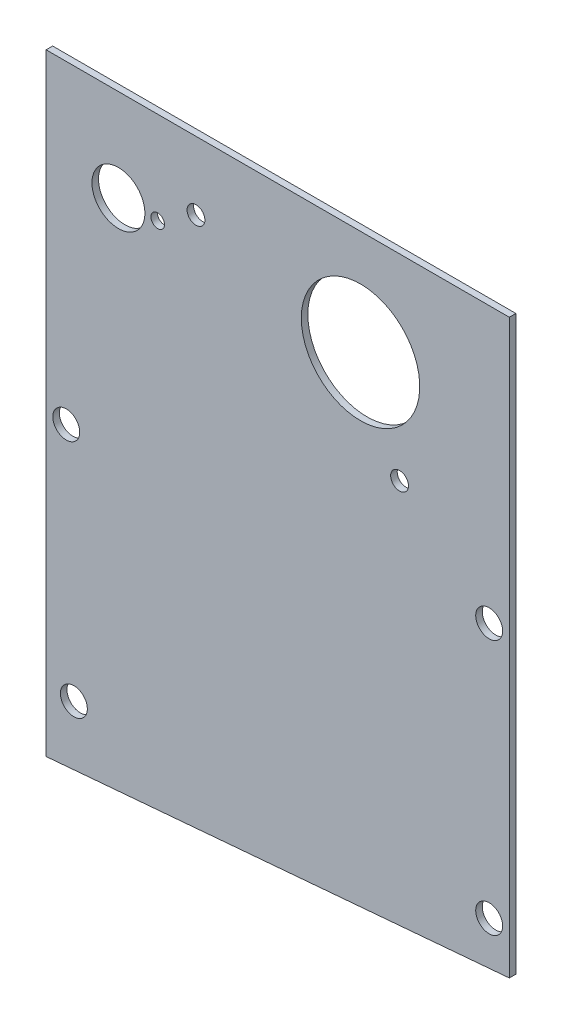
ISO-10303-21;
HEADER;
FILE_DESCRIPTION(('STEP AP214'),'2;1');
FILE_NAME('part.step','',(''),(''),'','','');
FILE_SCHEMA(('AUTOMOTIVE_DESIGN { 1 0 10303 214 1 1 1 1 }'));
ENDSEC;
DATA;
#1=APPLICATION_CONTEXT('core data for automotive mechanical design processes');
#2=APPLICATION_PROTOCOL_DEFINITION('international standard','automotive_design',2000,#1);
#3=PRODUCT_CONTEXT('',#1,'mechanical');
#4=PRODUCT('Part','Part','',(#3));
#5=PRODUCT_RELATED_PRODUCT_CATEGORY('part','',(#4));
#6=PRODUCT_DEFINITION_FORMATION('','',#4);
#7=PRODUCT_DEFINITION_CONTEXT('part definition',#1,'design');
#8=PRODUCT_DEFINITION('design','',#6,#7);
#9=PRODUCT_DEFINITION_SHAPE('','',#8);
#10=(LENGTH_UNIT() NAMED_UNIT(*) SI_UNIT(.MILLI.,.METRE.));
#11=(NAMED_UNIT(*) PLANE_ANGLE_UNIT() SI_UNIT($,.RADIAN.));
#12=(NAMED_UNIT(*) SI_UNIT($,.STERADIAN.) SOLID_ANGLE_UNIT());
#13=UNCERTAINTY_MEASURE_WITH_UNIT(LENGTH_MEASURE(1.E-05),#10,'distance_accuracy_value','');
#14=(GEOMETRIC_REPRESENTATION_CONTEXT(3) GLOBAL_UNCERTAINTY_ASSIGNED_CONTEXT((#13)) GLOBAL_UNIT_ASSIGNED_CONTEXT((#10,
#11,#12)) REPRESENTATION_CONTEXT('',''));
#15=CARTESIAN_POINT('',(0.,0.,0.));
#16=DIRECTION('',(0.,0.,1.));
#17=DIRECTION('',(1.,0.,0.));
#18=AXIS2_PLACEMENT_3D('',#15,#16,#17);
#19=CARTESIAN_POINT('',(56.134,-74.168,1.5875));
#20=DIRECTION('',(0.,0.,1.));
#21=DIRECTION('',(1.,0.,0.));
#22=AXIS2_PLACEMENT_3D('',#19,#20,#21);
#23=PLANE('',#22);
#24=CARTESIAN_POINT('',(76.2,-25.4,1.5875));
#25=DIRECTION('',(0.,0.,-1.));
#26=DIRECTION('',(-1.,0.,0.));
#27=AXIS2_PLACEMENT_3D('',#24,#25,#26);
#28=CIRCLE('',#27,14.351);
#29=CARTESIAN_POINT('',(61.849,-25.4,1.5875));
#30=VERTEX_POINT('',#29);
#31=EDGE_CURVE('E106',#30,#30,#28,.T.);
#32=ORIENTED_EDGE('',*,*,#31,.T.);
#33=EDGE_LOOP('',(#32));
#34=FACE_BOUND('',#33,.T.);
#35=CARTESIAN_POINT('',(36.322,-16.51,1.5875));
#36=DIRECTION('',(0.,0.,-1.));
#37=DIRECTION('',(-1.,0.,0.));
#38=AXIS2_PLACEMENT_3D('',#35,#36,#37);
#39=CIRCLE('',#38,2.159);
#40=CARTESIAN_POINT('',(34.163,-16.51,1.5875));
#41=VERTEX_POINT('',#40);
#42=EDGE_CURVE('E109',#41,#41,#39,.T.);
#43=ORIENTED_EDGE('',*,*,#42,.T.);
#44=EDGE_LOOP('',(#43));
#45=FACE_BOUND('',#44,.T.);
#46=CARTESIAN_POINT('',(85.6615,-47.625,1.5875));
#47=DIRECTION('',(0.,0.,-1.));
#48=DIRECTION('',(-1.,0.,0.));
#49=AXIS2_PLACEMENT_3D('',#46,#47,#48);
#50=CIRCLE('',#49,2.15899999999999);
#51=CARTESIAN_POINT('',(83.5025,-47.625,1.5875));
#52=VERTEX_POINT('',#51);
#53=EDGE_CURVE('E112',#52,#52,#50,.T.);
#54=ORIENTED_EDGE('',*,*,#53,.T.);
#55=EDGE_LOOP('',(#54));
#56=FACE_BOUND('',#55,.T.);
#57=CARTESIAN_POINT('',(27.051,-22.352,1.5875));
#58=DIRECTION('',(0.,0.,-1.));
#59=DIRECTION('',(-1.,0.,0.));
#60=AXIS2_PLACEMENT_3D('',#57,#58,#59);
#61=CIRCLE('',#60,1.651);
#62=CARTESIAN_POINT('',(25.4,-22.352,1.5875));
#63=VERTEX_POINT('',#62);
#64=EDGE_CURVE('E115',#63,#63,#61,.T.);
#65=ORIENTED_EDGE('',*,*,#64,.T.);
#66=EDGE_LOOP('',(#65));
#67=FACE_BOUND('',#66,.T.);
#68=CARTESIAN_POINT('',(17.526,-22.352,1.5875));
#69=DIRECTION('',(0.,0.,-1.));
#70=DIRECTION('',(-1.,0.,0.));
#71=AXIS2_PLACEMENT_3D('',#68,#69,#70);
#72=CIRCLE('',#71,6.4135);
#73=CARTESIAN_POINT('',(11.1125,-22.352,1.5875));
#74=VERTEX_POINT('',#73);
#75=EDGE_CURVE('E118',#74,#74,#72,.T.);
#76=ORIENTED_EDGE('',*,*,#75,.T.);
#77=EDGE_LOOP('',(#76));
#78=FACE_BOUND('',#77,.T.);
#79=CARTESIAN_POINT('',(107.3785,-128.5875,1.5875));
#80=DIRECTION('',(0.,0.,-1.));
#81=DIRECTION('',(-1.,0.,0.));
#82=AXIS2_PLACEMENT_3D('',#79,#80,#81);
#83=CIRCLE('',#82,3.2639);
#84=CARTESIAN_POINT('',(104.1146,-128.5875,1.5875));
#85=VERTEX_POINT('',#84);
#86=EDGE_CURVE('E121',#85,#85,#83,.T.);
#87=ORIENTED_EDGE('',*,*,#86,.T.);
#88=EDGE_LOOP('',(#87));
#89=FACE_BOUND('',#88,.T.);
#90=CARTESIAN_POINT('',(4.8895,-76.2,1.5875));
#91=DIRECTION('',(0.,0.,-1.));
#92=DIRECTION('',(-1.,0.,0.));
#93=AXIS2_PLACEMENT_3D('',#90,#91,#92);
#94=CIRCLE('',#93,3.2639);
#95=CARTESIAN_POINT('',(1.6256,-76.2,1.5875));
#96=VERTEX_POINT('',#95);
#97=EDGE_CURVE('E124',#96,#96,#94,.T.);
#98=ORIENTED_EDGE('',*,*,#97,.T.);
#99=EDGE_LOOP('',(#98));
#100=FACE_BOUND('',#99,.T.);
#101=CARTESIAN_POINT('',(6.731,-133.35,1.5875));
#102=DIRECTION('',(0.,0.,-1.));
#103=DIRECTION('',(-1.,0.,0.));
#104=AXIS2_PLACEMENT_3D('',#101,#102,#103);
#105=CIRCLE('',#104,3.2639);
#106=CARTESIAN_POINT('',(3.4671,-133.35,1.5875));
#107=VERTEX_POINT('',#106);
#108=EDGE_CURVE('E126',#107,#107,#105,.T.);
#109=ORIENTED_EDGE('',*,*,#108,.T.);
#110=EDGE_LOOP('',(#109));
#111=FACE_BOUND('',#110,.T.);
#112=CARTESIAN_POINT('',(107.3785,-66.675,1.5875));
#113=DIRECTION('',(0.,0.,-1.));
#114=DIRECTION('',(-1.,0.,0.));
#115=AXIS2_PLACEMENT_3D('',#112,#113,#114);
#116=CIRCLE('',#115,3.2639);
#117=CARTESIAN_POINT('',(104.1146,-66.675,1.5875));
#118=VERTEX_POINT('',#117);
#119=EDGE_CURVE('E19',#118,#118,#116,.T.);
#120=ORIENTED_EDGE('',*,*,#119,.T.);
#121=EDGE_LOOP('',(#120));
#122=FACE_BOUND('',#121,.T.);
#123=DIRECTION('',(1.,0.,0.));
#124=VECTOR('',#123,1.);
#125=CARTESIAN_POINT('',(112.268,0.,1.5875));
#126=LINE('',#125,#124);
#127=CARTESIAN_POINT('',(0.,0.,1.5875));
#128=VERTEX_POINT('',#127);
#129=CARTESIAN_POINT('',(112.268,0.,1.5875));
#130=VERTEX_POINT('',#129);
#131=EDGE_CURVE('E58',#128,#130,#126,.T.);
#132=ORIENTED_EDGE('',*,*,#131,.F.);
#133=DIRECTION('',(0.,1.,0.));
#134=VECTOR('',#133,1.);
#135=CARTESIAN_POINT('',(0.,0.,1.5875));
#136=LINE('',#135,#134);
#137=CARTESIAN_POINT('',(0.,-148.336,1.5875));
#138=VERTEX_POINT('',#137);
#139=EDGE_CURVE('E53',#138,#128,#136,.T.);
#140=ORIENTED_EDGE('',*,*,#139,.F.);
#141=DIRECTION('',(0.996324696011355,0.0856568743177184,0.));
#142=VECTOR('',#141,1.);
#143=CARTESIAN_POINT('',(0.,-148.336,1.5875));
#144=LINE('',#143,#142);
#145=CARTESIAN_POINT('',(112.268,-138.684,1.5875));
#146=VERTEX_POINT('',#145);
#147=EDGE_CURVE('E70',#146,#138,#144,.F.);
#148=ORIENTED_EDGE('',*,*,#147,.F.);
#149=DIRECTION('',(0.,1.,0.));
#150=VECTOR('',#149,1.);
#151=CARTESIAN_POINT('',(112.268,-138.684,1.5875));
#152=LINE('',#151,#150);
#153=EDGE_CURVE('E67',#130,#146,#152,.F.);
#154=ORIENTED_EDGE('',*,*,#153,.F.);
#155=EDGE_LOOP('',(#132,#140,#148,#154));
#156=FACE_BOUND('',#155,.T.);
#157=ADVANCED_FACE('F16',(#34,#45,#56,#67,#78,#89,#100,#111,#122,#156),#23,.T.);
#158=CARTESIAN_POINT('',(112.268,-138.684,0.));
#159=DIRECTION('',(1.,0.,0.));
#160=DIRECTION('',(0.,0.,-1.));
#161=AXIS2_PLACEMENT_3D('',#158,#159,#160);
#162=PLANE('',#161);
#163=ORIENTED_EDGE('',*,*,#153,.T.);
#164=DIRECTION('',(0.,0.,1.));
#165=VECTOR('',#164,1.);
#166=CARTESIAN_POINT('',(112.268,-138.684,0.));
#167=LINE('',#166,#165);
#168=CARTESIAN_POINT('',(112.268,-138.684,0.));
#169=VERTEX_POINT('',#168);
#170=EDGE_CURVE('E134',#169,#146,#167,.T.);
#171=ORIENTED_EDGE('',*,*,#170,.F.);
#172=DIRECTION('',(0.,1.,0.));
#173=VECTOR('',#172,1.);
#174=CARTESIAN_POINT('',(112.268,-74.168,0.));
#175=LINE('',#174,#173);
#176=CARTESIAN_POINT('',(112.268,0.,0.));
#177=VERTEX_POINT('',#176);
#178=EDGE_CURVE('E77',#169,#177,#175,.T.);
#179=ORIENTED_EDGE('',*,*,#178,.T.);
#180=DIRECTION('',(0.,0.,1.));
#181=VECTOR('',#180,1.);
#182=CARTESIAN_POINT('',(112.268,0.,0.));
#183=LINE('',#182,#181);
#184=EDGE_CURVE('E63',#130,#177,#183,.F.);
#185=ORIENTED_EDGE('',*,*,#184,.F.);
#186=EDGE_LOOP('',(#163,#171,#179,#185));
#187=FACE_BOUND('',#186,.T.);
#188=ADVANCED_FACE('F76',(#187),#162,.T.);
#189=CARTESIAN_POINT('',(112.268,0.,0.));
#190=DIRECTION('',(0.,1.,0.));
#191=DIRECTION('',(0.,0.,1.));
#192=AXIS2_PLACEMENT_3D('',#189,#190,#191);
#193=PLANE('',#192);
#194=ORIENTED_EDGE('',*,*,#131,.T.);
#195=ORIENTED_EDGE('',*,*,#184,.T.);
#196=DIRECTION('',(1.,0.,0.));
#197=VECTOR('',#196,1.);
#198=CARTESIAN_POINT('',(56.134,0.,0.));
#199=LINE('',#198,#197);
#200=CARTESIAN_POINT('',(0.,0.,0.));
#201=VERTEX_POINT('',#200);
#202=EDGE_CURVE('E145',#177,#201,#199,.F.);
#203=ORIENTED_EDGE('',*,*,#202,.T.);
#204=DIRECTION('',(0.,0.,1.));
#205=VECTOR('',#204,1.);
#206=CARTESIAN_POINT('',(0.,0.,0.));
#207=LINE('',#206,#205);
#208=EDGE_CURVE('E65',#128,#201,#207,.F.);
#209=ORIENTED_EDGE('',*,*,#208,.F.);
#210=EDGE_LOOP('',(#194,#195,#203,#209));
#211=FACE_BOUND('',#210,.T.);
#212=ADVANCED_FACE('F60',(#211),#193,.T.);
#213=CARTESIAN_POINT('',(0.,0.,0.));
#214=DIRECTION('',(-1.,0.,0.));
#215=DIRECTION('',(0.,0.,1.));
#216=AXIS2_PLACEMENT_3D('',#213,#214,#215);
#217=PLANE('',#216);
#218=ORIENTED_EDGE('',*,*,#139,.T.);
#219=ORIENTED_EDGE('',*,*,#208,.T.);
#220=DIRECTION('',(0.,1.,0.));
#221=VECTOR('',#220,1.);
#222=CARTESIAN_POINT('',(0.,-74.168,0.));
#223=LINE('',#222,#221);
#224=CARTESIAN_POINT('',(0.,-148.336,0.));
#225=VERTEX_POINT('',#224);
#226=EDGE_CURVE('E142',#201,#225,#223,.F.);
#227=ORIENTED_EDGE('',*,*,#226,.T.);
#228=DIRECTION('',(0.,0.,1.));
#229=VECTOR('',#228,1.);
#230=CARTESIAN_POINT('',(0.,-148.336,0.));
#231=LINE('',#230,#229);
#232=EDGE_CURVE('E34',#138,#225,#231,.F.);
#233=ORIENTED_EDGE('',*,*,#232,.F.);
#234=EDGE_LOOP('',(#218,#219,#227,#233));
#235=FACE_BOUND('',#234,.T.);
#236=ADVANCED_FACE('F141',(#235),#217,.T.);
#237=CARTESIAN_POINT('',(0.,-148.336,0.));
#238=DIRECTION('',(0.0856568743177184,-0.996324696011355,0.));
#239=DIRECTION('',(0.996324696011355,0.0856568743177184,0.));
#240=AXIS2_PLACEMENT_3D('',#237,#238,#239);
#241=PLANE('',#240);
#242=ORIENTED_EDGE('',*,*,#147,.T.);
#243=ORIENTED_EDGE('',*,*,#232,.T.);
#244=DIRECTION('',(0.996324696011355,0.0856568743177182,0.));
#245=VECTOR('',#244,1.);
#246=CARTESIAN_POINT('',(0.,-148.336,0.));
#247=LINE('',#246,#245);
#248=EDGE_CURVE('E105',#225,#169,#247,.T.);
#249=ORIENTED_EDGE('',*,*,#248,.T.);
#250=ORIENTED_EDGE('',*,*,#170,.T.);
#251=EDGE_LOOP('',(#242,#243,#249,#250));
#252=FACE_BOUND('',#251,.T.);
#253=ADVANCED_FACE('F148',(#252),#241,.T.);
#254=CARTESIAN_POINT('',(107.3785,-66.675,1.5875));
#255=DIRECTION('',(0.,0.,-1.));
#256=DIRECTION('',(-1.,0.,0.));
#257=AXIS2_PLACEMENT_3D('',#254,#255,#256);
#258=CYLINDRICAL_SURFACE('',#257,3.2639);
#259=CARTESIAN_POINT('',(107.3785,-66.675,0.));
#260=DIRECTION('',(0.,0.,-1.));
#261=DIRECTION('',(-1.,0.,0.));
#262=AXIS2_PLACEMENT_3D('',#259,#260,#261);
#263=CIRCLE('',#262,3.2639);
#264=CARTESIAN_POINT('',(104.1146,-66.675,0.));
#265=VERTEX_POINT('',#264);
#266=EDGE_CURVE('E102',#265,#265,#263,.T.);
#267=ORIENTED_EDGE('',*,*,#266,.T.);
#268=EDGE_LOOP('',(#267));
#269=FACE_BOUND('',#268,.T.);
#270=ORIENTED_EDGE('',*,*,#119,.F.);
#271=EDGE_LOOP('',(#270));
#272=FACE_BOUND('',#271,.T.);
#273=ADVANCED_FACE('F150',(#269,#272),#258,.F.);
#274=CARTESIAN_POINT('',(6.731,-133.35,1.5875));
#275=DIRECTION('',(0.,0.,-1.));
#276=DIRECTION('',(-1.,0.,0.));
#277=AXIS2_PLACEMENT_3D('',#274,#275,#276);
#278=CYLINDRICAL_SURFACE('',#277,3.2639);
#279=CARTESIAN_POINT('',(6.731,-133.35,0.));
#280=DIRECTION('',(0.,0.,-1.));
#281=DIRECTION('',(-1.,0.,0.));
#282=AXIS2_PLACEMENT_3D('',#279,#280,#281);
#283=CIRCLE('',#282,3.2639);
#284=CARTESIAN_POINT('',(3.4671,-133.35,0.));
#285=VERTEX_POINT('',#284);
#286=EDGE_CURVE('E99',#285,#285,#283,.T.);
#287=ORIENTED_EDGE('',*,*,#286,.T.);
#288=EDGE_LOOP('',(#287));
#289=FACE_BOUND('',#288,.T.);
#290=ORIENTED_EDGE('',*,*,#108,.F.);
#291=EDGE_LOOP('',(#290));
#292=FACE_BOUND('',#291,.T.);
#293=ADVANCED_FACE('F157',(#289,#292),#278,.F.);
#294=CARTESIAN_POINT('',(4.8895,-76.2,1.5875));
#295=DIRECTION('',(0.,0.,-1.));
#296=DIRECTION('',(-1.,0.,0.));
#297=AXIS2_PLACEMENT_3D('',#294,#295,#296);
#298=CYLINDRICAL_SURFACE('',#297,3.2639);
#299=CARTESIAN_POINT('',(4.8895,-76.2,0.));
#300=DIRECTION('',(0.,0.,-1.));
#301=DIRECTION('',(-1.,0.,0.));
#302=AXIS2_PLACEMENT_3D('',#299,#300,#301);
#303=CIRCLE('',#302,3.2639);
#304=CARTESIAN_POINT('',(1.6256,-76.2,0.));
#305=VERTEX_POINT('',#304);
#306=EDGE_CURVE('E96',#305,#305,#303,.T.);
#307=ORIENTED_EDGE('',*,*,#306,.T.);
#308=EDGE_LOOP('',(#307));
#309=FACE_BOUND('',#308,.T.);
#310=ORIENTED_EDGE('',*,*,#97,.F.);
#311=EDGE_LOOP('',(#310));
#312=FACE_BOUND('',#311,.T.);
#313=ADVANCED_FACE('F192',(#309,#312),#298,.F.);
#314=CARTESIAN_POINT('',(107.3785,-128.5875,1.5875));
#315=DIRECTION('',(0.,0.,-1.));
#316=DIRECTION('',(-1.,0.,0.));
#317=AXIS2_PLACEMENT_3D('',#314,#315,#316);
#318=CYLINDRICAL_SURFACE('',#317,3.2639);
#319=CARTESIAN_POINT('',(107.3785,-128.5875,0.));
#320=DIRECTION('',(0.,0.,-1.));
#321=DIRECTION('',(-1.,0.,0.));
#322=AXIS2_PLACEMENT_3D('',#319,#320,#321);
#323=CIRCLE('',#322,3.2639);
#324=CARTESIAN_POINT('',(104.1146,-128.5875,0.));
#325=VERTEX_POINT('',#324);
#326=EDGE_CURVE('E93',#325,#325,#323,.T.);
#327=ORIENTED_EDGE('',*,*,#326,.T.);
#328=EDGE_LOOP('',(#327));
#329=FACE_BOUND('',#328,.T.);
#330=ORIENTED_EDGE('',*,*,#86,.F.);
#331=EDGE_LOOP('',(#330));
#332=FACE_BOUND('',#331,.T.);
#333=ADVANCED_FACE('F188',(#329,#332),#318,.F.);
#334=CARTESIAN_POINT('',(17.526,-22.352,1.5875));
#335=DIRECTION('',(0.,0.,-1.));
#336=DIRECTION('',(-1.,0.,0.));
#337=AXIS2_PLACEMENT_3D('',#334,#335,#336);
#338=CYLINDRICAL_SURFACE('',#337,6.4135);
#339=CARTESIAN_POINT('',(17.526,-22.352,0.));
#340=DIRECTION('',(0.,0.,-1.));
#341=DIRECTION('',(-1.,0.,0.));
#342=AXIS2_PLACEMENT_3D('',#339,#340,#341);
#343=CIRCLE('',#342,6.4135);
#344=CARTESIAN_POINT('',(11.1125,-22.352,0.));
#345=VERTEX_POINT('',#344);
#346=EDGE_CURVE('E90',#345,#345,#343,.T.);
#347=ORIENTED_EDGE('',*,*,#346,.T.);
#348=EDGE_LOOP('',(#347));
#349=FACE_BOUND('',#348,.T.);
#350=ORIENTED_EDGE('',*,*,#75,.F.);
#351=EDGE_LOOP('',(#350));
#352=FACE_BOUND('',#351,.T.);
#353=ADVANCED_FACE('F184',(#349,#352),#338,.F.);
#354=CARTESIAN_POINT('',(27.051,-22.352,1.5875));
#355=DIRECTION('',(0.,0.,-1.));
#356=DIRECTION('',(-1.,0.,0.));
#357=AXIS2_PLACEMENT_3D('',#354,#355,#356);
#358=CYLINDRICAL_SURFACE('',#357,1.651);
#359=CARTESIAN_POINT('',(27.051,-22.352,0.));
#360=DIRECTION('',(0.,0.,-1.));
#361=DIRECTION('',(-1.,0.,0.));
#362=AXIS2_PLACEMENT_3D('',#359,#360,#361);
#363=CIRCLE('',#362,1.651);
#364=CARTESIAN_POINT('',(25.4,-22.352,0.));
#365=VERTEX_POINT('',#364);
#366=EDGE_CURVE('E87',#365,#365,#363,.T.);
#367=ORIENTED_EDGE('',*,*,#366,.T.);
#368=EDGE_LOOP('',(#367));
#369=FACE_BOUND('',#368,.T.);
#370=ORIENTED_EDGE('',*,*,#64,.F.);
#371=EDGE_LOOP('',(#370));
#372=FACE_BOUND('',#371,.T.);
#373=ADVANCED_FACE('F180',(#369,#372),#358,.F.);
#374=CARTESIAN_POINT('',(85.6615,-47.625,7.4295));
#375=DIRECTION('',(0.,0.,-1.));
#376=DIRECTION('',(-1.,0.,0.));
#377=AXIS2_PLACEMENT_3D('',#374,#375,#376);
#378=CYLINDRICAL_SURFACE('',#377,2.15899999999999);
#379=CARTESIAN_POINT('',(85.6615,-47.625,0.));
#380=DIRECTION('',(0.,0.,-1.));
#381=DIRECTION('',(-1.,0.,0.));
#382=AXIS2_PLACEMENT_3D('',#379,#380,#381);
#383=CIRCLE('',#382,2.15899999999999);
#384=CARTESIAN_POINT('',(83.5025,-47.625,0.));
#385=VERTEX_POINT('',#384);
#386=EDGE_CURVE('E84',#385,#385,#383,.T.);
#387=ORIENTED_EDGE('',*,*,#386,.T.);
#388=EDGE_LOOP('',(#387));
#389=FACE_BOUND('',#388,.T.);
#390=ORIENTED_EDGE('',*,*,#53,.F.);
#391=EDGE_LOOP('',(#390));
#392=FACE_BOUND('',#391,.T.);
#393=ADVANCED_FACE('F176',(#389,#392),#378,.F.);
#394=CARTESIAN_POINT('',(36.322,-16.51,7.4295));
#395=DIRECTION('',(0.,0.,-1.));
#396=DIRECTION('',(-1.,0.,0.));
#397=AXIS2_PLACEMENT_3D('',#394,#395,#396);
#398=CYLINDRICAL_SURFACE('',#397,2.159);
#399=CARTESIAN_POINT('',(36.322,-16.51,0.));
#400=DIRECTION('',(0.,0.,-1.));
#401=DIRECTION('',(-1.,0.,0.));
#402=AXIS2_PLACEMENT_3D('',#399,#400,#401);
#403=CIRCLE('',#402,2.159);
#404=CARTESIAN_POINT('',(34.163,-16.51,0.));
#405=VERTEX_POINT('',#404);
#406=EDGE_CURVE('E25',#405,#405,#403,.T.);
#407=ORIENTED_EDGE('',*,*,#406,.T.);
#408=EDGE_LOOP('',(#407));
#409=FACE_BOUND('',#408,.T.);
#410=ORIENTED_EDGE('',*,*,#42,.F.);
#411=EDGE_LOOP('',(#410));
#412=FACE_BOUND('',#411,.T.);
#413=ADVANCED_FACE('F168',(#409,#412),#398,.F.);
#414=CARTESIAN_POINT('',(76.2,-25.4,1.5875));
#415=DIRECTION('',(0.,0.,-1.));
#416=DIRECTION('',(-1.,0.,0.));
#417=AXIS2_PLACEMENT_3D('',#414,#415,#416);
#418=CYLINDRICAL_SURFACE('',#417,14.351);
#419=CARTESIAN_POINT('',(76.2,-25.4,0.));
#420=DIRECTION('',(0.,0.,-1.));
#421=DIRECTION('',(-1.,0.,0.));
#422=AXIS2_PLACEMENT_3D('',#419,#420,#421);
#423=CIRCLE('',#422,14.351);
#424=CARTESIAN_POINT('',(61.849,-25.4,0.));
#425=VERTEX_POINT('',#424);
#426=EDGE_CURVE('E11',#425,#425,#423,.T.);
#427=ORIENTED_EDGE('',*,*,#426,.T.);
#428=EDGE_LOOP('',(#427));
#429=FACE_BOUND('',#428,.T.);
#430=ORIENTED_EDGE('',*,*,#31,.F.);
#431=EDGE_LOOP('',(#430));
#432=FACE_BOUND('',#431,.T.);
#433=ADVANCED_FACE('F162',(#429,#432),#418,.F.);
#434=CARTESIAN_POINT('',(56.134,-74.168,0.));
#435=DIRECTION('',(0.,0.,1.));
#436=DIRECTION('',(1.,0.,0.));
#437=AXIS2_PLACEMENT_3D('',#434,#435,#436);
#438=PLANE('',#437);
#439=ORIENTED_EDGE('',*,*,#426,.F.);
#440=EDGE_LOOP('',(#439));
#441=FACE_BOUND('',#440,.T.);
#442=ORIENTED_EDGE('',*,*,#406,.F.);
#443=EDGE_LOOP('',(#442));
#444=FACE_BOUND('',#443,.T.);
#445=ORIENTED_EDGE('',*,*,#386,.F.);
#446=EDGE_LOOP('',(#445));
#447=FACE_BOUND('',#446,.T.);
#448=ORIENTED_EDGE('',*,*,#366,.F.);
#449=EDGE_LOOP('',(#448));
#450=FACE_BOUND('',#449,.T.);
#451=ORIENTED_EDGE('',*,*,#346,.F.);
#452=EDGE_LOOP('',(#451));
#453=FACE_BOUND('',#452,.T.);
#454=ORIENTED_EDGE('',*,*,#326,.F.);
#455=EDGE_LOOP('',(#454));
#456=FACE_BOUND('',#455,.T.);
#457=ORIENTED_EDGE('',*,*,#306,.F.);
#458=EDGE_LOOP('',(#457));
#459=FACE_BOUND('',#458,.T.);
#460=ORIENTED_EDGE('',*,*,#286,.F.);
#461=EDGE_LOOP('',(#460));
#462=FACE_BOUND('',#461,.T.);
#463=ORIENTED_EDGE('',*,*,#266,.F.);
#464=EDGE_LOOP('',(#463));
#465=FACE_BOUND('',#464,.T.);
#466=ORIENTED_EDGE('',*,*,#226,.F.);
#467=ORIENTED_EDGE('',*,*,#202,.F.);
#468=ORIENTED_EDGE('',*,*,#178,.F.);
#469=ORIENTED_EDGE('',*,*,#248,.F.);
#470=EDGE_LOOP('',(#466,#467,#468,#469));
#471=FACE_BOUND('',#470,.T.);
#472=ADVANCED_FACE('F144',(#441,#444,#447,#450,#453,#456,#459,#462,#465,#471),#438,.F.);
#473=CLOSED_SHELL('',(#157,#188,#212,#236,#253,#273,#293,#313,#333,#353,#373,#393,#413,#433,#472));
#474=MANIFOLD_SOLID_BREP('B1',#473);
#475=ADVANCED_BREP_SHAPE_REPRESENTATION('',(#18,#474),#14);
#476=SHAPE_DEFINITION_REPRESENTATION(#9,#475);
ENDSEC;
END-ISO-10303-21;
